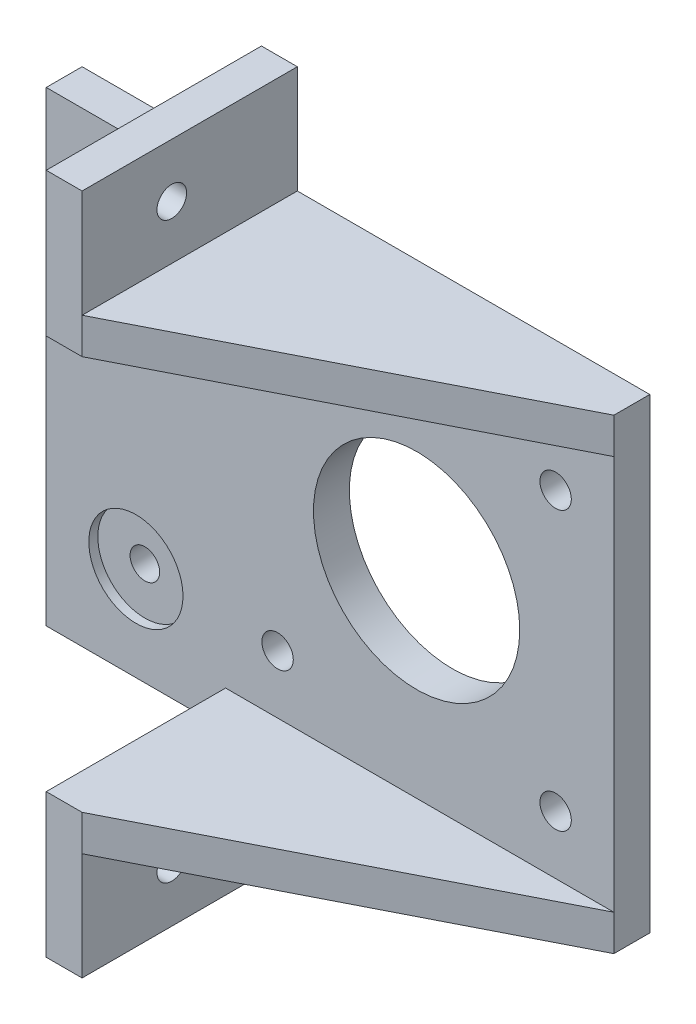
ISO-10303-21;
HEADER;
FILE_DESCRIPTION(('STEP AP214'),'2;1');
FILE_NAME('part.step','',(''),(''),'','','');
FILE_SCHEMA(('AUTOMOTIVE_DESIGN { 1 0 10303 214 1 1 1 1 }'));
ENDSEC;
DATA;
#1=APPLICATION_CONTEXT('core data for automotive mechanical design processes');
#2=APPLICATION_PROTOCOL_DEFINITION('international standard','automotive_design',2000,#1);
#3=PRODUCT_CONTEXT('',#1,'mechanical');
#4=PRODUCT('Part','Part','',(#3));
#5=PRODUCT_RELATED_PRODUCT_CATEGORY('part','',(#4));
#6=PRODUCT_DEFINITION_FORMATION('','',#4);
#7=PRODUCT_DEFINITION_CONTEXT('part definition',#1,'design');
#8=PRODUCT_DEFINITION('design','',#6,#7);
#9=PRODUCT_DEFINITION_SHAPE('','',#8);
#10=(LENGTH_UNIT() NAMED_UNIT(*) SI_UNIT(.MILLI.,.METRE.));
#11=(NAMED_UNIT(*) PLANE_ANGLE_UNIT() SI_UNIT($,.RADIAN.));
#12=(NAMED_UNIT(*) SI_UNIT($,.STERADIAN.) SOLID_ANGLE_UNIT());
#13=UNCERTAINTY_MEASURE_WITH_UNIT(LENGTH_MEASURE(1.E-05),#10,'distance_accuracy_value','');
#14=(GEOMETRIC_REPRESENTATION_CONTEXT(3) GLOBAL_UNCERTAINTY_ASSIGNED_CONTEXT((#13)) GLOBAL_UNIT_ASSIGNED_CONTEXT((#10,
#11,#12)) REPRESENTATION_CONTEXT('',''));
#15=CARTESIAN_POINT('',(0.,0.,0.));
#16=DIRECTION('',(0.,0.,1.));
#17=DIRECTION('',(1.,0.,0.));
#18=AXIS2_PLACEMENT_3D('',#15,#16,#17);
#19=CARTESIAN_POINT('',(-31.3,-15.5,25.));
#20=DIRECTION('',(0.,0.,-1.));
#21=DIRECTION('',(-1.,0.,0.));
#22=AXIS2_PLACEMENT_3D('',#19,#20,#21);
#23=CYLINDRICAL_SURFACE('',#22,1.65);
#24=CARTESIAN_POINT('',(-31.3,-15.5,0.));
#25=DIRECTION('',(0.,0.,1.));
#26=DIRECTION('',(1.,0.,0.));
#27=AXIS2_PLACEMENT_3D('',#24,#25,#26);
#28=CIRCLE('',#27,1.65);
#29=CARTESIAN_POINT('',(-29.65,-15.5,0.));
#30=VERTEX_POINT('',#29);
#31=EDGE_CURVE('E285',#30,#30,#28,.T.);
#32=ORIENTED_EDGE('',*,*,#31,.F.);
#33=EDGE_LOOP('',(#32));
#34=FACE_BOUND('',#33,.T.);
#35=CARTESIAN_POINT('',(-31.3,-15.5,3.));
#36=DIRECTION('',(0.,0.,1.));
#37=DIRECTION('',(1.,0.,0.));
#38=AXIS2_PLACEMENT_3D('',#35,#36,#37);
#39=CIRCLE('',#38,1.65);
#40=CARTESIAN_POINT('',(-29.65,-15.5,3.));
#41=VERTEX_POINT('',#40);
#42=EDGE_CURVE('E37',#41,#41,#39,.T.);
#43=ORIENTED_EDGE('',*,*,#42,.T.);
#44=EDGE_LOOP('',(#43));
#45=FACE_BOUND('',#44,.T.);
#46=ADVANCED_FACE('F33',(#34,#45),#23,.F.);
#47=CARTESIAN_POINT('',(-31.3,15.5,25.));
#48=DIRECTION('',(0.,0.,-1.));
#49=DIRECTION('',(-1.,0.,0.));
#50=AXIS2_PLACEMENT_3D('',#47,#48,#49);
#51=CYLINDRICAL_SURFACE('',#50,1.65);
#52=CARTESIAN_POINT('',(-31.3,15.5,0.));
#53=DIRECTION('',(0.,0.,1.));
#54=DIRECTION('',(1.,0.,0.));
#55=AXIS2_PLACEMENT_3D('',#52,#53,#54);
#56=CIRCLE('',#55,1.65);
#57=CARTESIAN_POINT('',(-29.65,15.5,0.));
#58=VERTEX_POINT('',#57);
#59=EDGE_CURVE('E282',#58,#58,#56,.T.);
#60=ORIENTED_EDGE('',*,*,#59,.F.);
#61=EDGE_LOOP('',(#60));
#62=FACE_BOUND('',#61,.T.);
#63=CARTESIAN_POINT('',(-31.3,15.5,3.));
#64=DIRECTION('',(0.,0.,1.));
#65=DIRECTION('',(1.,0.,0.));
#66=AXIS2_PLACEMENT_3D('',#63,#64,#65);
#67=CIRCLE('',#66,1.65);
#68=CARTESIAN_POINT('',(-29.65,15.5,3.));
#69=VERTEX_POINT('',#68);
#70=EDGE_CURVE('E329',#69,#69,#67,.T.);
#71=ORIENTED_EDGE('',*,*,#70,.T.);
#72=EDGE_LOOP('',(#71));
#73=FACE_BOUND('',#72,.T.);
#74=ADVANCED_FACE('F372',(#62,#73),#51,.F.);
#75=CARTESIAN_POINT('',(-17.3,32.,14.));
#76=DIRECTION('',(-1.,0.,0.));
#77=DIRECTION('',(0.,-1.,0.));
#78=AXIS2_PLACEMENT_3D('',#75,#76,#77);
#79=CYLINDRICAL_SURFACE('',#78,1.65);
#80=CARTESIAN_POINT('',(-17.3,32.,14.));
#81=DIRECTION('',(-1.,0.,0.));
#82=DIRECTION('',(0.,-1.,0.));
#83=AXIS2_PLACEMENT_3D('',#80,#81,#82);
#84=CIRCLE('',#83,1.65);
#85=CARTESIAN_POINT('',(-17.3,30.35,14.));
#86=VERTEX_POINT('',#85);
#87=EDGE_CURVE('E201',#86,#86,#84,.T.);
#88=ORIENTED_EDGE('',*,*,#87,.F.);
#89=EDGE_LOOP('',(#88));
#90=FACE_BOUND('',#89,.T.);
#91=CARTESIAN_POINT('',(-20.3,32.,14.));
#92=DIRECTION('',(-1.,0.,0.));
#93=DIRECTION('',(0.,-1.,0.));
#94=AXIS2_PLACEMENT_3D('',#91,#92,#93);
#95=CIRCLE('',#94,1.65);
#96=CARTESIAN_POINT('',(-20.3,30.35,14.));
#97=VERTEX_POINT('',#96);
#98=EDGE_CURVE('E325',#97,#97,#95,.F.);
#99=ORIENTED_EDGE('',*,*,#98,.F.);
#100=EDGE_LOOP('',(#99));
#101=FACE_BOUND('',#100,.T.);
#102=ADVANCED_FACE('F378',(#90,#101),#79,.F.);
#103=CARTESIAN_POINT('',(-17.3,-32.,14.));
#104=DIRECTION('',(-1.,0.,0.));
#105=DIRECTION('',(0.,-1.,0.));
#106=AXIS2_PLACEMENT_3D('',#103,#104,#105);
#107=CYLINDRICAL_SURFACE('',#106,1.65);
#108=CARTESIAN_POINT('',(-17.3,-32.,14.));
#109=DIRECTION('',(1.,0.,0.));
#110=DIRECTION('',(0.,1.,0.));
#111=AXIS2_PLACEMENT_3D('',#108,#109,#110);
#112=CIRCLE('',#111,1.65);
#113=CARTESIAN_POINT('',(-17.3,-30.35,14.));
#114=VERTEX_POINT('',#113);
#115=EDGE_CURVE('E180',#114,#114,#112,.T.);
#116=ORIENTED_EDGE('',*,*,#115,.T.);
#117=EDGE_LOOP('',(#116));
#118=FACE_BOUND('',#117,.T.);
#119=CARTESIAN_POINT('',(-20.3,-32.,14.));
#120=DIRECTION('',(-1.,0.,0.));
#121=DIRECTION('',(0.,-1.,0.));
#122=AXIS2_PLACEMENT_3D('',#119,#120,#121);
#123=CIRCLE('',#122,1.65);
#124=CARTESIAN_POINT('',(-20.3,-33.65,14.));
#125=VERTEX_POINT('',#124);
#126=EDGE_CURVE('E321',#125,#125,#123,.T.);
#127=ORIENTED_EDGE('',*,*,#126,.T.);
#128=EDGE_LOOP('',(#127));
#129=FACE_BOUND('',#128,.T.);
#130=ADVANCED_FACE('F356',(#118,#129),#107,.F.);
#131=CARTESIAN_POINT('',(22.,-26.,25.));
#132=DIRECTION('',(0.,1.,0.));
#133=DIRECTION('',(-1.,0.,0.));
#134=AXIS2_PLACEMENT_3D('',#131,#132,#133);
#135=PLANE('',#134);
#136=DIRECTION('',(0.,0.,1.));
#137=VECTOR('',#136,1.);
#138=CARTESIAN_POINT('',(-17.3,-26.,25.));
#139=LINE('',#138,#137);
#140=CARTESIAN_POINT('',(-17.3,-26.,0.));
#141=VERTEX_POINT('',#140);
#142=CARTESIAN_POINT('',(-17.3,-26.,24.));
#143=VERTEX_POINT('',#142);
#144=EDGE_CURVE('E185',#141,#143,#139,.T.);
#145=ORIENTED_EDGE('',*,*,#144,.F.);
#146=DIRECTION('',(1.,0.,0.));
#147=VECTOR('',#146,1.);
#148=CARTESIAN_POINT('',(22.,-26.,0.));
#149=LINE('',#148,#147);
#150=CARTESIAN_POINT('',(22.,-26.,0.));
#151=VERTEX_POINT('',#150);
#152=EDGE_CURVE('E172',#141,#151,#149,.T.);
#153=ORIENTED_EDGE('',*,*,#152,.T.);
#154=DIRECTION('',(0.,0.,-1.));
#155=VECTOR('',#154,1.);
#156=CARTESIAN_POINT('',(22.,-26.,25.));
#157=LINE('',#156,#155);
#158=CARTESIAN_POINT('',(22.,-26.,4.));
#159=VERTEX_POINT('',#158);
#160=EDGE_CURVE('E314',#159,#151,#157,.T.);
#161=ORIENTED_EDGE('',*,*,#160,.F.);
#162=DIRECTION('',(0.891229787296541,0.,-0.453552054603838));
#163=VECTOR('',#162,1.);
#164=CARTESIAN_POINT('',(22.,-26.,4.));
#165=LINE('',#164,#163);
#166=EDGE_CURVE('E187',#143,#159,#165,.T.);
#167=ORIENTED_EDGE('',*,*,#166,.F.);
#168=EDGE_LOOP('',(#145,#153,#161,#167));
#169=FACE_BOUND('',#168,.T.);
#170=ADVANCED_FACE('F412',(#169),#135,.F.);
#171=CARTESIAN_POINT('',(0.,-26.,4.));
#172=DIRECTION('',(0.,0.,1.));
#173=DIRECTION('',(1.,0.,0.));
#174=AXIS2_PLACEMENT_3D('',#171,#172,#173);
#175=PLANE('',#174);
#176=CARTESIAN_POINT('',(-31.3,-15.5,4.));
#177=DIRECTION('',(0.,0.,1.));
#178=DIRECTION('',(1.,0.,0.));
#179=AXIS2_PLACEMENT_3D('',#176,#177,#178);
#180=CIRCLE('',#179,5.25);
#181=CARTESIAN_POINT('',(-26.05,-15.5,4.));
#182=VERTEX_POINT('',#181);
#183=EDGE_CURVE('E345',#182,#182,#180,.T.);
#184=ORIENTED_EDGE('',*,*,#183,.F.);
#185=EDGE_LOOP('',(#184));
#186=FACE_BOUND('',#185,.T.);
#187=CARTESIAN_POINT('',(-31.3,15.5,4.));
#188=DIRECTION('',(0.,0.,1.));
#189=DIRECTION('',(1.,0.,0.));
#190=AXIS2_PLACEMENT_3D('',#187,#188,#189);
#191=CIRCLE('',#190,5.25);
#192=CARTESIAN_POINT('',(-26.05,15.5,4.));
#193=VERTEX_POINT('',#192);
#194=EDGE_CURVE('E338',#193,#193,#191,.T.);
#195=ORIENTED_EDGE('',*,*,#194,.F.);
#196=EDGE_LOOP('',(#195));
#197=FACE_BOUND('',#196,.T.);
#198=CARTESIAN_POINT('',(0.,0.,4.));
#199=DIRECTION('',(0.,0.,1.));
#200=DIRECTION('',(1.,0.,0.));
#201=AXIS2_PLACEMENT_3D('',#198,#199,#200);
#202=CIRCLE('',#201,11.5);
#203=CARTESIAN_POINT('',(11.5,0.,3.99999999999999));
#204=VERTEX_POINT('',#203);
#205=EDGE_CURVE('E279',#204,#204,#202,.T.);
#206=ORIENTED_EDGE('',*,*,#205,.F.);
#207=EDGE_LOOP('',(#206));
#208=FACE_BOUND('',#207,.T.);
#209=CARTESIAN_POINT('',(-15.5,15.5,4.));
#210=DIRECTION('',(0.,0.,1.));
#211=DIRECTION('',(1.,0.,0.));
#212=AXIS2_PLACEMENT_3D('',#209,#210,#211);
#213=CIRCLE('',#212,1.75);
#214=CARTESIAN_POINT('',(-13.75,15.5,4.));
#215=VERTEX_POINT('',#214);
#216=EDGE_CURVE('E276',#215,#215,#213,.T.);
#217=ORIENTED_EDGE('',*,*,#216,.F.);
#218=EDGE_LOOP('',(#217));
#219=FACE_BOUND('',#218,.T.);
#220=CARTESIAN_POINT('',(15.5,15.5,3.99999999999999));
#221=DIRECTION('',(0.,0.,1.));
#222=DIRECTION('',(1.,0.,0.));
#223=AXIS2_PLACEMENT_3D('',#220,#221,#222);
#224=CIRCLE('',#223,1.75);
#225=CARTESIAN_POINT('',(17.25,15.5,3.99999999999999));
#226=VERTEX_POINT('',#225);
#227=EDGE_CURVE('E273',#226,#226,#224,.T.);
#228=ORIENTED_EDGE('',*,*,#227,.F.);
#229=EDGE_LOOP('',(#228));
#230=FACE_BOUND('',#229,.T.);
#231=CARTESIAN_POINT('',(15.5,-15.5,3.99999999999999));
#232=DIRECTION('',(0.,0.,1.));
#233=DIRECTION('',(1.,0.,0.));
#234=AXIS2_PLACEMENT_3D('',#231,#232,#233);
#235=CIRCLE('',#234,1.75);
#236=CARTESIAN_POINT('',(17.25,-15.5,3.99999999999999));
#237=VERTEX_POINT('',#236);
#238=EDGE_CURVE('E270',#237,#237,#235,.T.);
#239=ORIENTED_EDGE('',*,*,#238,.F.);
#240=EDGE_LOOP('',(#239));
#241=FACE_BOUND('',#240,.T.);
#242=CARTESIAN_POINT('',(-15.5,-15.5,4.));
#243=DIRECTION('',(0.,0.,1.));
#244=DIRECTION('',(1.,0.,0.));
#245=AXIS2_PLACEMENT_3D('',#242,#243,#244);
#246=CIRCLE('',#245,1.75);
#247=CARTESIAN_POINT('',(-13.75,-15.5,4.));
#248=VERTEX_POINT('',#247);
#249=EDGE_CURVE('E264',#248,#248,#246,.T.);
#250=ORIENTED_EDGE('',*,*,#249,.F.);
#251=EDGE_LOOP('',(#250));
#252=FACE_BOUND('',#251,.T.);
#253=DIRECTION('',(1.,0.,0.));
#254=VECTOR('',#253,1.);
#255=CARTESIAN_POINT('',(0.,-26.,4.));
#256=LINE('',#255,#254);
#257=CARTESIAN_POINT('',(-41.3,-26.,4.));
#258=VERTEX_POINT('',#257);
#259=CARTESIAN_POINT('',(-21.3,-26.,4.));
#260=VERTEX_POINT('',#259);
#261=EDGE_CURVE('E257',#258,#260,#256,.T.);
#262=ORIENTED_EDGE('',*,*,#261,.T.);
#263=DIRECTION('',(0.,-1.,0.));
#264=VECTOR('',#263,1.);
#265=CARTESIAN_POINT('',(-21.3,-22.,4.00000000000001));
#266=LINE('',#265,#264);
#267=CARTESIAN_POINT('',(-21.3,-22.,4.));
#268=VERTEX_POINT('',#267);
#269=EDGE_CURVE('E198',#268,#260,#266,.T.);
#270=ORIENTED_EDGE('',*,*,#269,.F.);
#271=DIRECTION('',(-1.,0.,0.));
#272=VECTOR('',#271,1.);
#273=CARTESIAN_POINT('',(-21.3,-22.,4.00000000000001));
#274=LINE('',#273,#272);
#275=CARTESIAN_POINT('',(22.,-22.,4.));
#276=VERTEX_POINT('',#275);
#277=EDGE_CURVE('E58',#276,#268,#274,.T.);
#278=ORIENTED_EDGE('',*,*,#277,.F.);
#279=DIRECTION('',(0.,1.,0.));
#280=VECTOR('',#279,1.);
#281=CARTESIAN_POINT('',(22.,-26.,4.));
#282=LINE('',#281,#280);
#283=CARTESIAN_POINT('',(22.,22.,4.));
#284=VERTEX_POINT('',#283);
#285=EDGE_CURVE('E260',#276,#284,#282,.T.);
#286=ORIENTED_EDGE('',*,*,#285,.T.);
#287=DIRECTION('',(-1.,0.,0.));
#288=VECTOR('',#287,1.);
#289=CARTESIAN_POINT('',(-21.3,22.,4.00000000000001));
#290=LINE('',#289,#288);
#291=CARTESIAN_POINT('',(-21.3,22.,4.00000000000001));
#292=VERTEX_POINT('',#291);
#293=EDGE_CURVE('E231',#284,#292,#290,.T.);
#294=ORIENTED_EDGE('',*,*,#293,.T.);
#295=DIRECTION('',(0.,1.,0.));
#296=VECTOR('',#295,1.);
#297=CARTESIAN_POINT('',(-21.3,22.,4.00000000000001));
#298=LINE('',#297,#296);
#299=CARTESIAN_POINT('',(-21.3,26.,4.00000000000001));
#300=VERTEX_POINT('',#299);
#301=EDGE_CURVE('E242',#292,#300,#298,.T.);
#302=ORIENTED_EDGE('',*,*,#301,.T.);
#303=DIRECTION('',(1.,0.,0.));
#304=VECTOR('',#303,1.);
#305=CARTESIAN_POINT('',(0.,26.,4.));
#306=LINE('',#305,#304);
#307=CARTESIAN_POINT('',(-41.3,26.,4.00000000000001));
#308=VERTEX_POINT('',#307);
#309=EDGE_CURVE('E247',#308,#300,#306,.T.);
#310=ORIENTED_EDGE('',*,*,#309,.F.);
#311=DIRECTION('',(0.,1.,0.));
#312=VECTOR('',#311,1.);
#313=CARTESIAN_POINT('',(-41.3,-26.,4.00000000000001));
#314=LINE('',#313,#312);
#315=EDGE_CURVE('E261',#258,#308,#314,.T.);
#316=ORIENTED_EDGE('',*,*,#315,.F.);
#317=EDGE_LOOP('',(#262,#270,#278,#286,#294,#302,#310,#316));
#318=FACE_BOUND('',#317,.T.);
#319=ADVANCED_FACE('F424',(#186,#197,#208,#219,#230,#241,#252,#318),#175,.T.);
#320=CARTESIAN_POINT('',(22.,26.,25.));
#321=DIRECTION('',(0.,-1.,0.));
#322=DIRECTION('',(1.,0.,0.));
#323=AXIS2_PLACEMENT_3D('',#320,#321,#322);
#324=PLANE('',#323);
#325=DIRECTION('',(0.,0.,-1.));
#326=VECTOR('',#325,1.);
#327=CARTESIAN_POINT('',(-17.3,26.,25.));
#328=LINE('',#327,#326);
#329=CARTESIAN_POINT('',(-17.3,26.,24.));
#330=VERTEX_POINT('',#329);
#331=CARTESIAN_POINT('',(-17.3,26.,0.));
#332=VERTEX_POINT('',#331);
#333=EDGE_CURVE('E228',#330,#332,#328,.T.);
#334=ORIENTED_EDGE('',*,*,#333,.F.);
#335=DIRECTION('',(0.891229787296541,0.,-0.453552054603838));
#336=VECTOR('',#335,1.);
#337=CARTESIAN_POINT('',(22.,26.,4.));
#338=LINE('',#337,#336);
#339=CARTESIAN_POINT('',(22.,26.,4.));
#340=VERTEX_POINT('',#339);
#341=EDGE_CURVE('E230',#330,#340,#338,.T.);
#342=ORIENTED_EDGE('',*,*,#341,.T.);
#343=DIRECTION('',(0.,0.,-1.));
#344=VECTOR('',#343,1.);
#345=CARTESIAN_POINT('',(22.,26.,25.));
#346=LINE('',#345,#344);
#347=CARTESIAN_POINT('',(22.,26.,0.));
#348=VERTEX_POINT('',#347);
#349=EDGE_CURVE('E11',#340,#348,#346,.T.);
#350=ORIENTED_EDGE('',*,*,#349,.T.);
#351=DIRECTION('',(-1.,0.,0.));
#352=VECTOR('',#351,1.);
#353=CARTESIAN_POINT('',(22.,26.,0.));
#354=LINE('',#353,#352);
#355=EDGE_CURVE('E307',#348,#332,#354,.T.);
#356=ORIENTED_EDGE('',*,*,#355,.T.);
#357=EDGE_LOOP('',(#334,#342,#350,#356));
#358=FACE_BOUND('',#357,.T.);
#359=ADVANCED_FACE('F418',(#358),#324,.F.);
#360=CARTESIAN_POINT('',(22.,26.,25.));
#361=DIRECTION('',(-1.,0.,0.));
#362=DIRECTION('',(0.,0.,1.));
#363=AXIS2_PLACEMENT_3D('',#360,#361,#362);
#364=PLANE('',#363);
#365=EDGE_CURVE('E265',#159,#276,#282,.T.);
#366=ORIENTED_EDGE('',*,*,#365,.F.);
#367=ORIENTED_EDGE('',*,*,#160,.T.);
#368=DIRECTION('',(0.,1.,0.));
#369=VECTOR('',#368,1.);
#370=CARTESIAN_POINT('',(22.,26.,0.));
#371=LINE('',#370,#369);
#372=EDGE_CURVE('E303',#151,#348,#371,.T.);
#373=ORIENTED_EDGE('',*,*,#372,.T.);
#374=ORIENTED_EDGE('',*,*,#349,.F.);
#375=DIRECTION('',(0.,1.,0.));
#376=VECTOR('',#375,1.);
#377=CARTESIAN_POINT('',(22.,22.,4.));
#378=LINE('',#377,#376);
#379=EDGE_CURVE('E245',#284,#340,#378,.T.);
#380=ORIENTED_EDGE('',*,*,#379,.F.);
#381=ORIENTED_EDGE('',*,*,#285,.F.);
#382=EDGE_LOOP('',(#366,#367,#373,#374,#380,#381));
#383=FACE_BOUND('',#382,.T.);
#384=ADVANCED_FACE('F35',(#383),#364,.F.);
#385=ORIENTED_EDGE('',*,*,#309,.T.);
#386=DIRECTION('',(0.,0.,-1.));
#387=VECTOR('',#386,1.);
#388=CARTESIAN_POINT('',(-21.3,26.,25.));
#389=LINE('',#388,#387);
#390=CARTESIAN_POINT('',(-21.3,26.,0.));
#391=VERTEX_POINT('',#390);
#392=EDGE_CURVE('E223',#300,#391,#389,.T.);
#393=ORIENTED_EDGE('',*,*,#392,.T.);
#394=CARTESIAN_POINT('',(-41.3,26.,0.));
#395=VERTEX_POINT('',#394);
#396=EDGE_CURVE('E306',#391,#395,#354,.T.);
#397=ORIENTED_EDGE('',*,*,#396,.T.);
#398=DIRECTION('',(0.,0.,-1.));
#399=VECTOR('',#398,1.);
#400=CARTESIAN_POINT('',(-41.3,26.,25.));
#401=LINE('',#400,#399);
#402=EDGE_CURVE('E42',#308,#395,#401,.T.);
#403=ORIENTED_EDGE('',*,*,#402,.F.);
#404=EDGE_LOOP('',(#385,#393,#397,#403));
#405=FACE_BOUND('',#404,.T.);
#406=ADVANCED_FACE('F414',(#405),#324,.F.);
#407=CARTESIAN_POINT('',(-41.3,26.,25.));
#408=DIRECTION('',(1.,0.,0.));
#409=DIRECTION('',(0.,0.,-1.));
#410=AXIS2_PLACEMENT_3D('',#407,#408,#409);
#411=PLANE('',#410);
#412=ORIENTED_EDGE('',*,*,#315,.T.);
#413=ORIENTED_EDGE('',*,*,#402,.T.);
#414=DIRECTION('',(0.,-1.,0.));
#415=VECTOR('',#414,1.);
#416=CARTESIAN_POINT('',(-41.3,26.,0.));
#417=LINE('',#416,#415);
#418=CARTESIAN_POINT('',(-41.3,-26.,0.));
#419=VERTEX_POINT('',#418);
#420=EDGE_CURVE('E310',#395,#419,#417,.T.);
#421=ORIENTED_EDGE('',*,*,#420,.T.);
#422=DIRECTION('',(0.,0.,-1.));
#423=VECTOR('',#422,1.);
#424=CARTESIAN_POINT('',(-41.3,-26.,25.));
#425=LINE('',#424,#423);
#426=EDGE_CURVE('E317',#258,#419,#425,.T.);
#427=ORIENTED_EDGE('',*,*,#426,.F.);
#428=EDGE_LOOP('',(#412,#413,#421,#427));
#429=FACE_BOUND('',#428,.T.);
#430=ADVANCED_FACE('F411',(#429),#411,.F.);
#431=CARTESIAN_POINT('',(-21.3,-26.,0.));
#432=VERTEX_POINT('',#431);
#433=EDGE_CURVE('E50',#419,#432,#149,.T.);
#434=ORIENTED_EDGE('',*,*,#433,.T.);
#435=DIRECTION('',(0.,0.,1.));
#436=VECTOR('',#435,1.);
#437=CARTESIAN_POINT('',(-21.3,-26.,25.));
#438=LINE('',#437,#436);
#439=EDGE_CURVE('E182',#432,#260,#438,.T.);
#440=ORIENTED_EDGE('',*,*,#439,.T.);
#441=ORIENTED_EDGE('',*,*,#261,.F.);
#442=ORIENTED_EDGE('',*,*,#426,.T.);
#443=EDGE_LOOP('',(#434,#440,#441,#442));
#444=FACE_BOUND('',#443,.T.);
#445=ADVANCED_FACE('F404',(#444),#135,.F.);
#446=CARTESIAN_POINT('',(0.,0.,25.));
#447=DIRECTION('',(0.,0.,-1.));
#448=DIRECTION('',(-1.,0.,0.));
#449=AXIS2_PLACEMENT_3D('',#446,#447,#448);
#450=CYLINDRICAL_SURFACE('',#449,11.5);
#451=CARTESIAN_POINT('',(0.,0.,0.));
#452=DIRECTION('',(0.,0.,1.));
#453=DIRECTION('',(1.,0.,0.));
#454=AXIS2_PLACEMENT_3D('',#451,#452,#453);
#455=CIRCLE('',#454,11.5);
#456=CARTESIAN_POINT('',(11.5,0.,0.));
#457=VERTEX_POINT('',#456);
#458=EDGE_CURVE('E300',#457,#457,#455,.T.);
#459=ORIENTED_EDGE('',*,*,#458,.F.);
#460=EDGE_LOOP('',(#459));
#461=FACE_BOUND('',#460,.T.);
#462=ORIENTED_EDGE('',*,*,#205,.T.);
#463=EDGE_LOOP('',(#462));
#464=FACE_BOUND('',#463,.T.);
#465=ADVANCED_FACE('F400',(#461,#464),#450,.F.);
#466=CARTESIAN_POINT('',(-15.5,15.5,25.));
#467=DIRECTION('',(0.,0.,-1.));
#468=DIRECTION('',(-1.,0.,0.));
#469=AXIS2_PLACEMENT_3D('',#466,#467,#468);
#470=CYLINDRICAL_SURFACE('',#469,1.75);
#471=CARTESIAN_POINT('',(-15.5,15.5,0.));
#472=DIRECTION('',(0.,0.,1.));
#473=DIRECTION('',(1.,0.,0.));
#474=AXIS2_PLACEMENT_3D('',#471,#472,#473);
#475=CIRCLE('',#474,1.75);
#476=CARTESIAN_POINT('',(-13.75,15.5,0.));
#477=VERTEX_POINT('',#476);
#478=EDGE_CURVE('E297',#477,#477,#475,.T.);
#479=ORIENTED_EDGE('',*,*,#478,.F.);
#480=EDGE_LOOP('',(#479));
#481=FACE_BOUND('',#480,.T.);
#482=ORIENTED_EDGE('',*,*,#216,.T.);
#483=EDGE_LOOP('',(#482));
#484=FACE_BOUND('',#483,.T.);
#485=ADVANCED_FACE('F396',(#481,#484),#470,.F.);
#486=CARTESIAN_POINT('',(15.5,15.5,25.));
#487=DIRECTION('',(0.,0.,-1.));
#488=DIRECTION('',(-1.,0.,0.));
#489=AXIS2_PLACEMENT_3D('',#486,#487,#488);
#490=CYLINDRICAL_SURFACE('',#489,1.75);
#491=CARTESIAN_POINT('',(15.5,15.5,0.));
#492=DIRECTION('',(0.,0.,1.));
#493=DIRECTION('',(1.,0.,0.));
#494=AXIS2_PLACEMENT_3D('',#491,#492,#493);
#495=CIRCLE('',#494,1.75);
#496=CARTESIAN_POINT('',(17.25,15.5,0.));
#497=VERTEX_POINT('',#496);
#498=EDGE_CURVE('E294',#497,#497,#495,.T.);
#499=ORIENTED_EDGE('',*,*,#498,.F.);
#500=EDGE_LOOP('',(#499));
#501=FACE_BOUND('',#500,.T.);
#502=ORIENTED_EDGE('',*,*,#227,.T.);
#503=EDGE_LOOP('',(#502));
#504=FACE_BOUND('',#503,.T.);
#505=ADVANCED_FACE('F392',(#501,#504),#490,.F.);
#506=CARTESIAN_POINT('',(15.5,-15.5,25.));
#507=DIRECTION('',(0.,0.,-1.));
#508=DIRECTION('',(-1.,0.,0.));
#509=AXIS2_PLACEMENT_3D('',#506,#507,#508);
#510=CYLINDRICAL_SURFACE('',#509,1.75);
#511=CARTESIAN_POINT('',(15.5,-15.5,0.));
#512=DIRECTION('',(0.,0.,1.));
#513=DIRECTION('',(1.,0.,0.));
#514=AXIS2_PLACEMENT_3D('',#511,#512,#513);
#515=CIRCLE('',#514,1.75);
#516=CARTESIAN_POINT('',(17.25,-15.5,0.));
#517=VERTEX_POINT('',#516);
#518=EDGE_CURVE('E291',#517,#517,#515,.T.);
#519=ORIENTED_EDGE('',*,*,#518,.F.);
#520=EDGE_LOOP('',(#519));
#521=FACE_BOUND('',#520,.T.);
#522=ORIENTED_EDGE('',*,*,#238,.T.);
#523=EDGE_LOOP('',(#522));
#524=FACE_BOUND('',#523,.T.);
#525=ADVANCED_FACE('F388',(#521,#524),#510,.F.);
#526=CARTESIAN_POINT('',(-15.5,-15.5,25.));
#527=DIRECTION('',(0.,0.,-1.));
#528=DIRECTION('',(-1.,0.,0.));
#529=AXIS2_PLACEMENT_3D('',#526,#527,#528);
#530=CYLINDRICAL_SURFACE('',#529,1.75);
#531=CARTESIAN_POINT('',(-15.5,-15.5,0.));
#532=DIRECTION('',(0.,0.,1.));
#533=DIRECTION('',(1.,0.,0.));
#534=AXIS2_PLACEMENT_3D('',#531,#532,#533);
#535=CIRCLE('',#534,1.75);
#536=CARTESIAN_POINT('',(-13.75,-15.5,0.));
#537=VERTEX_POINT('',#536);
#538=EDGE_CURVE('E288',#537,#537,#535,.T.);
#539=ORIENTED_EDGE('',*,*,#538,.F.);
#540=EDGE_LOOP('',(#539));
#541=FACE_BOUND('',#540,.T.);
#542=ORIENTED_EDGE('',*,*,#249,.T.);
#543=EDGE_LOOP('',(#542));
#544=FACE_BOUND('',#543,.T.);
#545=ADVANCED_FACE('F385',(#541,#544),#530,.F.);
#546=CARTESIAN_POINT('',(0.,0.,0.));
#547=DIRECTION('',(0.,0.,-1.));
#548=DIRECTION('',(-1.,0.,0.));
#549=AXIS2_PLACEMENT_3D('',#546,#547,#548);
#550=PLANE('',#549);
#551=ORIENTED_EDGE('',*,*,#152,.F.);
#552=DIRECTION('',(0.,1.,0.));
#553=VECTOR('',#552,1.);
#554=CARTESIAN_POINT('',(-17.3,-22.,0.));
#555=LINE('',#554,#553);
#556=CARTESIAN_POINT('',(-17.3,-38.,0.));
#557=VERTEX_POINT('',#556);
#558=EDGE_CURVE('E152',#557,#141,#555,.T.);
#559=ORIENTED_EDGE('',*,*,#558,.F.);
#560=DIRECTION('',(-1.,0.,0.));
#561=VECTOR('',#560,1.);
#562=CARTESIAN_POINT('',(-17.3,-38.,0.));
#563=LINE('',#562,#561);
#564=CARTESIAN_POINT('',(-21.3,-38.,0.));
#565=VERTEX_POINT('',#564);
#566=EDGE_CURVE('E158',#557,#565,#563,.T.);
#567=ORIENTED_EDGE('',*,*,#566,.T.);
#568=DIRECTION('',(0.,1.,0.));
#569=VECTOR('',#568,1.);
#570=CARTESIAN_POINT('',(-21.3,-22.,0.));
#571=LINE('',#570,#569);
#572=EDGE_CURVE('E178',#565,#432,#571,.T.);
#573=ORIENTED_EDGE('',*,*,#572,.T.);
#574=ORIENTED_EDGE('',*,*,#433,.F.);
#575=ORIENTED_EDGE('',*,*,#420,.F.);
#576=ORIENTED_EDGE('',*,*,#396,.F.);
#577=DIRECTION('',(0.,-1.,0.));
#578=VECTOR('',#577,1.);
#579=CARTESIAN_POINT('',(-21.3,22.,0.));
#580=LINE('',#579,#578);
#581=CARTESIAN_POINT('',(-21.3,38.,0.));
#582=VERTEX_POINT('',#581);
#583=EDGE_CURVE('E211',#582,#391,#580,.T.);
#584=ORIENTED_EDGE('',*,*,#583,.F.);
#585=DIRECTION('',(-1.,0.,0.));
#586=VECTOR('',#585,1.);
#587=CARTESIAN_POINT('',(-17.3,38.,0.));
#588=LINE('',#587,#586);
#589=CARTESIAN_POINT('',(-17.3,38.,0.));
#590=VERTEX_POINT('',#589);
#591=EDGE_CURVE('E221',#590,#582,#588,.T.);
#592=ORIENTED_EDGE('',*,*,#591,.F.);
#593=DIRECTION('',(0.,-1.,0.));
#594=VECTOR('',#593,1.);
#595=CARTESIAN_POINT('',(-17.3,22.,0.));
#596=LINE('',#595,#594);
#597=EDGE_CURVE('E214',#590,#332,#596,.T.);
#598=ORIENTED_EDGE('',*,*,#597,.T.);
#599=ORIENTED_EDGE('',*,*,#355,.F.);
#600=ORIENTED_EDGE('',*,*,#372,.F.);
#601=EDGE_LOOP('',(#551,#559,#567,#573,#574,#575,#576,#584,#592,#598,#599,#600));
#602=FACE_BOUND('',#601,.T.);
#603=ORIENTED_EDGE('',*,*,#31,.T.);
#604=EDGE_LOOP('',(#603));
#605=FACE_BOUND('',#604,.T.);
#606=ORIENTED_EDGE('',*,*,#518,.T.);
#607=EDGE_LOOP('',(#606));
#608=FACE_BOUND('',#607,.T.);
#609=ORIENTED_EDGE('',*,*,#478,.T.);
#610=EDGE_LOOP('',(#609));
#611=FACE_BOUND('',#610,.T.);
#612=ORIENTED_EDGE('',*,*,#458,.T.);
#613=EDGE_LOOP('',(#612));
#614=FACE_BOUND('',#613,.T.);
#615=ORIENTED_EDGE('',*,*,#498,.T.);
#616=EDGE_LOOP('',(#615));
#617=FACE_BOUND('',#616,.T.);
#618=ORIENTED_EDGE('',*,*,#538,.T.);
#619=EDGE_LOOP('',(#618));
#620=FACE_BOUND('',#619,.T.);
#621=ORIENTED_EDGE('',*,*,#59,.T.);
#622=EDGE_LOOP('',(#621));
#623=FACE_BOUND('',#622,.T.);
#624=ADVANCED_FACE('F169',(#602,#605,#608,#611,#614,#617,#620,#623),#550,.T.);
#625=CARTESIAN_POINT('',(22.,22.,4.));
#626=DIRECTION('',(0.453552054603838,0.,0.891229787296541));
#627=DIRECTION('',(0.891229787296541,0.,-0.453552054603838));
#628=AXIS2_PLACEMENT_3D('',#625,#626,#627);
#629=PLANE('',#628);
#630=ORIENTED_EDGE('',*,*,#341,.F.);
#631=DIRECTION('',(0.,1.,0.));
#632=VECTOR('',#631,1.);
#633=CARTESIAN_POINT('',(-17.3,22.,24.));
#634=LINE('',#633,#632);
#635=CARTESIAN_POINT('',(-17.3,22.,24.));
#636=VERTEX_POINT('',#635);
#637=EDGE_CURVE('E248',#636,#330,#634,.T.);
#638=ORIENTED_EDGE('',*,*,#637,.F.);
#639=DIRECTION('',(0.891229787296541,0.,-0.453552054603838));
#640=VECTOR('',#639,1.);
#641=CARTESIAN_POINT('',(22.,22.,4.));
#642=LINE('',#641,#640);
#643=EDGE_CURVE('E239',#636,#284,#642,.T.);
#644=ORIENTED_EDGE('',*,*,#643,.T.);
#645=ORIENTED_EDGE('',*,*,#379,.T.);
#646=EDGE_LOOP('',(#630,#638,#644,#645));
#647=FACE_BOUND('',#646,.T.);
#648=ADVANCED_FACE('F408',(#647),#629,.T.);
#649=CARTESIAN_POINT('',(-17.3,22.,24.));
#650=DIRECTION('',(0.,0.,1.));
#651=DIRECTION('',(1.,0.,0.));
#652=AXIS2_PLACEMENT_3D('',#649,#650,#651);
#653=PLANE('',#652);
#654=ORIENTED_EDGE('',*,*,#637,.T.);
#655=DIRECTION('',(0.,1.,0.));
#656=VECTOR('',#655,1.);
#657=CARTESIAN_POINT('',(-17.3,22.,24.));
#658=LINE('',#657,#656);
#659=CARTESIAN_POINT('',(-17.3,38.,24.));
#660=VERTEX_POINT('',#659);
#661=EDGE_CURVE('E208',#330,#660,#658,.T.);
#662=ORIENTED_EDGE('',*,*,#661,.T.);
#663=DIRECTION('',(-1.,0.,0.));
#664=VECTOR('',#663,1.);
#665=CARTESIAN_POINT('',(-17.3,38.,24.));
#666=LINE('',#665,#664);
#667=CARTESIAN_POINT('',(-21.3,38.,24.));
#668=VERTEX_POINT('',#667);
#669=EDGE_CURVE('E217',#660,#668,#666,.T.);
#670=ORIENTED_EDGE('',*,*,#669,.T.);
#671=DIRECTION('',(0.,1.,0.));
#672=VECTOR('',#671,1.);
#673=CARTESIAN_POINT('',(-21.3,22.,24.));
#674=LINE('',#673,#672);
#675=CARTESIAN_POINT('',(-21.3,22.,24.));
#676=VERTEX_POINT('',#675);
#677=EDGE_CURVE('E251',#676,#668,#674,.T.);
#678=ORIENTED_EDGE('',*,*,#677,.F.);
#679=DIRECTION('',(1.,0.,0.));
#680=VECTOR('',#679,1.);
#681=CARTESIAN_POINT('',(-17.3,22.,24.));
#682=LINE('',#681,#680);
#683=EDGE_CURVE('E236',#676,#636,#682,.T.);
#684=ORIENTED_EDGE('',*,*,#683,.T.);
#685=EDGE_LOOP('',(#654,#662,#670,#678,#684));
#686=FACE_BOUND('',#685,.T.);
#687=ADVANCED_FACE('F437',(#686),#653,.T.);
#688=CARTESIAN_POINT('',(-21.3,22.,24.));
#689=DIRECTION('',(-1.,0.,0.));
#690=DIRECTION('',(0.,-1.,0.));
#691=AXIS2_PLACEMENT_3D('',#688,#689,#690);
#692=PLANE('',#691);
#693=CARTESIAN_POINT('',(-21.3,32.,14.));
#694=DIRECTION('',(-1.,0.,0.));
#695=DIRECTION('',(0.,-1.,0.));
#696=AXIS2_PLACEMENT_3D('',#693,#694,#695);
#697=CIRCLE('',#696,5.25);
#698=CARTESIAN_POINT('',(-21.3,26.75,14.));
#699=VERTEX_POINT('',#698);
#700=EDGE_CURVE('E331',#699,#699,#697,.T.);
#701=ORIENTED_EDGE('',*,*,#700,.F.);
#702=EDGE_LOOP('',(#701));
#703=FACE_BOUND('',#702,.T.);
#704=ORIENTED_EDGE('',*,*,#677,.T.);
#705=DIRECTION('',(0.,0.,-1.));
#706=VECTOR('',#705,1.);
#707=CARTESIAN_POINT('',(-21.3,38.,24.));
#708=LINE('',#707,#706);
#709=EDGE_CURVE('E207',#668,#582,#708,.T.);
#710=ORIENTED_EDGE('',*,*,#709,.T.);
#711=ORIENTED_EDGE('',*,*,#583,.T.);
#712=ORIENTED_EDGE('',*,*,#392,.F.);
#713=ORIENTED_EDGE('',*,*,#301,.F.);
#714=DIRECTION('',(0.,0.,1.));
#715=VECTOR('',#714,1.);
#716=CARTESIAN_POINT('',(-21.3,22.,24.));
#717=LINE('',#716,#715);
#718=EDGE_CURVE('E233',#292,#676,#717,.T.);
#719=ORIENTED_EDGE('',*,*,#718,.T.);
#720=EDGE_LOOP('',(#704,#710,#711,#712,#713,#719));
#721=FACE_BOUND('',#720,.T.);
#722=ADVANCED_FACE('F457',(#703,#721),#692,.T.);
#723=CARTESIAN_POINT('',(0.,22.,0.));
#724=DIRECTION('',(0.,1.,0.));
#725=DIRECTION('',(-1.,0.,0.));
#726=AXIS2_PLACEMENT_3D('',#723,#724,#725);
#727=PLANE('',#726);
#728=ORIENTED_EDGE('',*,*,#718,.F.);
#729=ORIENTED_EDGE('',*,*,#293,.F.);
#730=ORIENTED_EDGE('',*,*,#643,.F.);
#731=ORIENTED_EDGE('',*,*,#683,.F.);
#732=EDGE_LOOP('',(#728,#729,#730,#731));
#733=FACE_BOUND('',#732,.T.);
#734=ADVANCED_FACE('F454',(#733),#727,.F.);
#735=CARTESIAN_POINT('',(-17.3,0.,0.));
#736=DIRECTION('',(-1.,0.,0.));
#737=DIRECTION('',(0.,0.,1.));
#738=AXIS2_PLACEMENT_3D('',#735,#736,#737);
#739=PLANE('',#738);
#740=ORIENTED_EDGE('',*,*,#87,.T.);
#741=EDGE_LOOP('',(#740));
#742=FACE_BOUND('',#741,.T.);
#743=ORIENTED_EDGE('',*,*,#661,.F.);
#744=ORIENTED_EDGE('',*,*,#333,.T.);
#745=ORIENTED_EDGE('',*,*,#597,.F.);
#746=DIRECTION('',(0.,0.,-1.));
#747=VECTOR('',#746,1.);
#748=CARTESIAN_POINT('',(-17.3,38.,24.));
#749=LINE('',#748,#747);
#750=EDGE_CURVE('E210',#660,#590,#749,.T.);
#751=ORIENTED_EDGE('',*,*,#750,.F.);
#752=EDGE_LOOP('',(#743,#744,#745,#751));
#753=FACE_BOUND('',#752,.T.);
#754=ADVANCED_FACE('F447',(#742,#753),#739,.F.);
#755=CARTESIAN_POINT('',(-17.3,38.,24.));
#756=DIRECTION('',(0.,1.,0.));
#757=DIRECTION('',(-1.,0.,0.));
#758=AXIS2_PLACEMENT_3D('',#755,#756,#757);
#759=PLANE('',#758);
#760=ORIENTED_EDGE('',*,*,#709,.F.);
#761=ORIENTED_EDGE('',*,*,#669,.F.);
#762=ORIENTED_EDGE('',*,*,#750,.T.);
#763=ORIENTED_EDGE('',*,*,#591,.T.);
#764=EDGE_LOOP('',(#760,#761,#762,#763));
#765=FACE_BOUND('',#764,.T.);
#766=ADVANCED_FACE('F450',(#765),#759,.T.);
#767=CARTESIAN_POINT('',(-21.3,-22.,24.));
#768=DIRECTION('',(1.,0.,0.));
#769=DIRECTION('',(0.,1.,0.));
#770=AXIS2_PLACEMENT_3D('',#767,#768,#769);
#771=PLANE('',#770);
#772=CARTESIAN_POINT('',(-21.3,-32.,14.));
#773=DIRECTION('',(-1.,0.,0.));
#774=DIRECTION('',(0.,-1.,0.));
#775=AXIS2_PLACEMENT_3D('',#772,#773,#774);
#776=CIRCLE('',#775,5.25);
#777=CARTESIAN_POINT('',(-21.3,-37.25,14.));
#778=VERTEX_POINT('',#777);
#779=EDGE_CURVE('E327',#778,#778,#776,.T.);
#780=ORIENTED_EDGE('',*,*,#779,.F.);
#781=EDGE_LOOP('',(#780));
#782=FACE_BOUND('',#781,.T.);
#783=ORIENTED_EDGE('',*,*,#269,.T.);
#784=ORIENTED_EDGE('',*,*,#439,.F.);
#785=ORIENTED_EDGE('',*,*,#572,.F.);
#786=DIRECTION('',(0.,0.,-1.));
#787=VECTOR('',#786,1.);
#788=CARTESIAN_POINT('',(-21.3,-38.,24.));
#789=LINE('',#788,#787);
#790=CARTESIAN_POINT('',(-21.3,-38.,24.));
#791=VERTEX_POINT('',#790);
#792=EDGE_CURVE('E163',#791,#565,#789,.T.);
#793=ORIENTED_EDGE('',*,*,#792,.F.);
#794=DIRECTION('',(0.,-1.,0.));
#795=VECTOR('',#794,1.);
#796=CARTESIAN_POINT('',(-21.3,-22.,24.));
#797=LINE('',#796,#795);
#798=CARTESIAN_POINT('',(-21.3,-22.,24.));
#799=VERTEX_POINT('',#798);
#800=EDGE_CURVE('E202',#799,#791,#797,.T.);
#801=ORIENTED_EDGE('',*,*,#800,.F.);
#802=DIRECTION('',(0.,0.,1.));
#803=VECTOR('',#802,1.);
#804=CARTESIAN_POINT('',(-21.3,-22.,24.));
#805=LINE('',#804,#803);
#806=EDGE_CURVE('E193',#268,#799,#805,.T.);
#807=ORIENTED_EDGE('',*,*,#806,.F.);
#808=EDGE_LOOP('',(#783,#784,#785,#793,#801,#807));
#809=FACE_BOUND('',#808,.T.);
#810=ADVANCED_FACE('F464',(#782,#809),#771,.F.);
#811=CARTESIAN_POINT('',(-17.3,-22.,24.));
#812=DIRECTION('',(0.,0.,-1.));
#813=DIRECTION('',(-1.,0.,0.));
#814=AXIS2_PLACEMENT_3D('',#811,#812,#813);
#815=PLANE('',#814);
#816=ORIENTED_EDGE('',*,*,#800,.T.);
#817=DIRECTION('',(-1.,0.,0.));
#818=VECTOR('',#817,1.);
#819=CARTESIAN_POINT('',(-17.3,-38.,24.));
#820=LINE('',#819,#818);
#821=CARTESIAN_POINT('',(-17.3,-38.,24.));
#822=VERTEX_POINT('',#821);
#823=EDGE_CURVE('E167',#822,#791,#820,.T.);
#824=ORIENTED_EDGE('',*,*,#823,.F.);
#825=DIRECTION('',(0.,-1.,0.));
#826=VECTOR('',#825,1.);
#827=CARTESIAN_POINT('',(-17.3,-22.,24.));
#828=LINE('',#827,#826);
#829=EDGE_CURVE('E154',#143,#822,#828,.T.);
#830=ORIENTED_EDGE('',*,*,#829,.F.);
#831=DIRECTION('',(0.,-1.,0.));
#832=VECTOR('',#831,1.);
#833=CARTESIAN_POINT('',(-17.3,-22.,24.));
#834=LINE('',#833,#832);
#835=CARTESIAN_POINT('',(-17.3,-22.,24.));
#836=VERTEX_POINT('',#835);
#837=EDGE_CURVE('E195',#836,#143,#834,.T.);
#838=ORIENTED_EDGE('',*,*,#837,.F.);
#839=DIRECTION('',(1.,0.,0.));
#840=VECTOR('',#839,1.);
#841=CARTESIAN_POINT('',(-17.3,-22.,24.));
#842=LINE('',#841,#840);
#843=EDGE_CURVE('E191',#799,#836,#842,.T.);
#844=ORIENTED_EDGE('',*,*,#843,.F.);
#845=EDGE_LOOP('',(#816,#824,#830,#838,#844));
#846=FACE_BOUND('',#845,.T.);
#847=ADVANCED_FACE('F472',(#846),#815,.F.);
#848=CARTESIAN_POINT('',(22.,-22.,4.));
#849=DIRECTION('',(-0.453552054603838,0.,-0.891229787296541));
#850=DIRECTION('',(-0.891229787296541,0.,0.453552054603838));
#851=AXIS2_PLACEMENT_3D('',#848,#849,#850);
#852=PLANE('',#851);
#853=ORIENTED_EDGE('',*,*,#166,.T.);
#854=ORIENTED_EDGE('',*,*,#365,.T.);
#855=DIRECTION('',(0.891229787296541,0.,-0.453552054603838));
#856=VECTOR('',#855,1.);
#857=CARTESIAN_POINT('',(22.,-22.,4.));
#858=LINE('',#857,#856);
#859=EDGE_CURVE('E189',#836,#276,#858,.T.);
#860=ORIENTED_EDGE('',*,*,#859,.F.);
#861=ORIENTED_EDGE('',*,*,#837,.T.);
#862=EDGE_LOOP('',(#853,#854,#860,#861));
#863=FACE_BOUND('',#862,.T.);
#864=ADVANCED_FACE('F368',(#863),#852,.F.);
#865=CARTESIAN_POINT('',(0.,-22.,0.));
#866=DIRECTION('',(0.,-1.,0.));
#867=DIRECTION('',(-1.,0.,0.));
#868=AXIS2_PLACEMENT_3D('',#865,#866,#867);
#869=PLANE('',#868);
#870=ORIENTED_EDGE('',*,*,#843,.T.);
#871=ORIENTED_EDGE('',*,*,#859,.T.);
#872=ORIENTED_EDGE('',*,*,#277,.T.);
#873=ORIENTED_EDGE('',*,*,#806,.T.);
#874=EDGE_LOOP('',(#870,#871,#872,#873));
#875=FACE_BOUND('',#874,.T.);
#876=ADVANCED_FACE('F360',(#875),#869,.F.);
#877=CARTESIAN_POINT('',(-17.3,0.,0.));
#878=DIRECTION('',(-1.,0.,0.));
#879=DIRECTION('',(0.,0.,1.));
#880=AXIS2_PLACEMENT_3D('',#877,#878,#879);
#881=PLANE('',#880);
#882=ORIENTED_EDGE('',*,*,#115,.F.);
#883=EDGE_LOOP('',(#882));
#884=FACE_BOUND('',#883,.T.);
#885=ORIENTED_EDGE('',*,*,#558,.T.);
#886=ORIENTED_EDGE('',*,*,#144,.T.);
#887=ORIENTED_EDGE('',*,*,#829,.T.);
#888=DIRECTION('',(0.,0.,-1.));
#889=VECTOR('',#888,1.);
#890=CARTESIAN_POINT('',(-17.3,-38.,24.));
#891=LINE('',#890,#889);
#892=EDGE_CURVE('E147',#822,#557,#891,.T.);
#893=ORIENTED_EDGE('',*,*,#892,.T.);
#894=EDGE_LOOP('',(#885,#886,#887,#893));
#895=FACE_BOUND('',#894,.T.);
#896=ADVANCED_FACE('F149',(#884,#895),#881,.F.);
#897=CARTESIAN_POINT('',(-17.3,-38.,24.));
#898=DIRECTION('',(0.,1.,0.));
#899=DIRECTION('',(-1.,0.,0.));
#900=AXIS2_PLACEMENT_3D('',#897,#898,#899);
#901=PLANE('',#900);
#902=ORIENTED_EDGE('',*,*,#792,.T.);
#903=ORIENTED_EDGE('',*,*,#566,.F.);
#904=ORIENTED_EDGE('',*,*,#892,.F.);
#905=ORIENTED_EDGE('',*,*,#823,.T.);
#906=EDGE_LOOP('',(#902,#903,#904,#905));
#907=FACE_BOUND('',#906,.T.);
#908=ADVANCED_FACE('F161',(#907),#901,.F.);
#909=CARTESIAN_POINT('',(-20.3,-32.,14.));
#910=DIRECTION('',(-1.,0.,0.));
#911=DIRECTION('',(0.,-1.,0.));
#912=AXIS2_PLACEMENT_3D('',#909,#910,#911);
#913=CYLINDRICAL_SURFACE('',#912,5.25);
#914=CARTESIAN_POINT('',(-20.3,-32.,14.));
#915=DIRECTION('',(-1.,0.,0.));
#916=DIRECTION('',(0.,-1.,0.));
#917=AXIS2_PLACEMENT_3D('',#914,#915,#916);
#918=CIRCLE('',#917,5.25);
#919=CARTESIAN_POINT('',(-20.3,-37.25,14.));
#920=VERTEX_POINT('',#919);
#921=EDGE_CURVE('E324',#920,#920,#918,.T.);
#922=ORIENTED_EDGE('',*,*,#921,.F.);
#923=EDGE_LOOP('',(#922));
#924=FACE_BOUND('',#923,.T.);
#925=ORIENTED_EDGE('',*,*,#779,.T.);
#926=EDGE_LOOP('',(#925));
#927=FACE_BOUND('',#926,.T.);
#928=ADVANCED_FACE('F366',(#924,#927),#913,.F.);
#929=CARTESIAN_POINT('',(-20.3,-32.,14.));
#930=DIRECTION('',(-1.,0.,0.));
#931=DIRECTION('',(0.,-1.,0.));
#932=AXIS2_PLACEMENT_3D('',#929,#930,#931);
#933=PLANE('',#932);
#934=ORIENTED_EDGE('',*,*,#126,.F.);
#935=EDGE_LOOP('',(#934));
#936=FACE_BOUND('',#935,.T.);
#937=ORIENTED_EDGE('',*,*,#921,.T.);
#938=EDGE_LOOP('',(#937));
#939=FACE_BOUND('',#938,.T.);
#940=ADVANCED_FACE('F488',(#936,#939),#933,.T.);
#941=CARTESIAN_POINT('',(-20.3,32.,14.));
#942=DIRECTION('',(-1.,0.,0.));
#943=DIRECTION('',(0.,-1.,0.));
#944=AXIS2_PLACEMENT_3D('',#941,#942,#943);
#945=PLANE('',#944);
#946=CARTESIAN_POINT('',(-20.3,32.,14.));
#947=DIRECTION('',(-1.,0.,0.));
#948=DIRECTION('',(0.,-1.,0.));
#949=AXIS2_PLACEMENT_3D('',#946,#947,#948);
#950=CIRCLE('',#949,5.25);
#951=CARTESIAN_POINT('',(-20.3,26.75,14.));
#952=VERTEX_POINT('',#951);
#953=EDGE_CURVE('E328',#952,#952,#950,.T.);
#954=ORIENTED_EDGE('',*,*,#953,.T.);
#955=EDGE_LOOP('',(#954));
#956=FACE_BOUND('',#955,.T.);
#957=ORIENTED_EDGE('',*,*,#98,.T.);
#958=EDGE_LOOP('',(#957));
#959=FACE_BOUND('',#958,.T.);
#960=ADVANCED_FACE('F492',(#956,#959),#945,.T.);
#961=CARTESIAN_POINT('',(-20.3,32.,14.));
#962=DIRECTION('',(-1.,0.,0.));
#963=DIRECTION('',(0.,-1.,0.));
#964=AXIS2_PLACEMENT_3D('',#961,#962,#963);
#965=CYLINDRICAL_SURFACE('',#964,5.25);
#966=ORIENTED_EDGE('',*,*,#953,.F.);
#967=EDGE_LOOP('',(#966));
#968=FACE_BOUND('',#967,.T.);
#969=ORIENTED_EDGE('',*,*,#700,.T.);
#970=EDGE_LOOP('',(#969));
#971=FACE_BOUND('',#970,.T.);
#972=ADVANCED_FACE('F494',(#968,#971),#965,.F.);
#973=CARTESIAN_POINT('',(-31.3,15.5,3.));
#974=DIRECTION('',(0.,0.,1.));
#975=DIRECTION('',(1.,0.,0.));
#976=AXIS2_PLACEMENT_3D('',#973,#974,#975);
#977=CYLINDRICAL_SURFACE('',#976,5.25);
#978=CARTESIAN_POINT('',(-31.3,15.5,3.));
#979=DIRECTION('',(0.,0.,1.));
#980=DIRECTION('',(1.,0.,0.));
#981=AXIS2_PLACEMENT_3D('',#978,#979,#980);
#982=CIRCLE('',#981,5.25);
#983=CARTESIAN_POINT('',(-26.05,15.5,3.));
#984=VERTEX_POINT('',#983);
#985=EDGE_CURVE('E332',#984,#984,#982,.T.);
#986=ORIENTED_EDGE('',*,*,#985,.F.);
#987=EDGE_LOOP('',(#986));
#988=FACE_BOUND('',#987,.T.);
#989=ORIENTED_EDGE('',*,*,#194,.T.);
#990=EDGE_LOOP('',(#989));
#991=FACE_BOUND('',#990,.T.);
#992=ADVANCED_FACE('F497',(#988,#991),#977,.F.);
#993=CARTESIAN_POINT('',(-31.3,15.5,3.));
#994=DIRECTION('',(0.,0.,1.));
#995=DIRECTION('',(1.,0.,0.));
#996=AXIS2_PLACEMENT_3D('',#993,#994,#995);
#997=PLANE('',#996);
#998=ORIENTED_EDGE('',*,*,#70,.F.);
#999=EDGE_LOOP('',(#998));
#1000=FACE_BOUND('',#999,.T.);
#1001=ORIENTED_EDGE('',*,*,#985,.T.);
#1002=EDGE_LOOP('',(#1001));
#1003=FACE_BOUND('',#1002,.T.);
#1004=ADVANCED_FACE('F504',(#1000,#1003),#997,.T.);
#1005=CARTESIAN_POINT('',(-31.3,-15.5,3.));
#1006=DIRECTION('',(0.,0.,1.));
#1007=DIRECTION('',(1.,0.,0.));
#1008=AXIS2_PLACEMENT_3D('',#1005,#1006,#1007);
#1009=CYLINDRICAL_SURFACE('',#1008,5.25);
#1010=CARTESIAN_POINT('',(-31.3,-15.5,3.));
#1011=DIRECTION('',(0.,0.,1.));
#1012=DIRECTION('',(1.,0.,0.));
#1013=AXIS2_PLACEMENT_3D('',#1010,#1011,#1012);
#1014=CIRCLE('',#1013,5.25);
#1015=CARTESIAN_POINT('',(-26.05,-15.5,3.));
#1016=VERTEX_POINT('',#1015);
#1017=EDGE_CURVE('E523',#1016,#1016,#1014,.T.);
#1018=ORIENTED_EDGE('',*,*,#1017,.F.);
#1019=EDGE_LOOP('',(#1018));
#1020=FACE_BOUND('',#1019,.T.);
#1021=ORIENTED_EDGE('',*,*,#183,.T.);
#1022=EDGE_LOOP('',(#1021));
#1023=FACE_BOUND('',#1022,.T.);
#1024=ADVANCED_FACE('F508',(#1020,#1023),#1009,.F.);
#1025=CARTESIAN_POINT('',(-31.3,-15.5,3.));
#1026=DIRECTION('',(0.,0.,1.));
#1027=DIRECTION('',(1.,0.,0.));
#1028=AXIS2_PLACEMENT_3D('',#1025,#1026,#1027);
#1029=PLANE('',#1028);
#1030=ORIENTED_EDGE('',*,*,#42,.F.);
#1031=EDGE_LOOP('',(#1030));
#1032=FACE_BOUND('',#1031,.T.);
#1033=ORIENTED_EDGE('',*,*,#1017,.T.);
#1034=EDGE_LOOP('',(#1033));
#1035=FACE_BOUND('',#1034,.T.);
#1036=ADVANCED_FACE('F512',(#1032,#1035),#1029,.T.);
#1037=CLOSED_SHELL('',(#46,#74,#102,#130,#170,#319,#359,#384,#406,#430,#445,#465,#485,#505,#525,
#545,#624,#648,#687,#722,#734,#754,#766,#810,#847,#864,#876,#896,#908,#928,#940,#960,#972,#992,
#1004,#1024,#1036));
#1038=MANIFOLD_SOLID_BREP('B2',#1037);
#1039=ADVANCED_BREP_SHAPE_REPRESENTATION('',(#18,#1038),#14);
#1040=SHAPE_DEFINITION_REPRESENTATION(#9,#1039);
ENDSEC;
END-ISO-10303-21;
